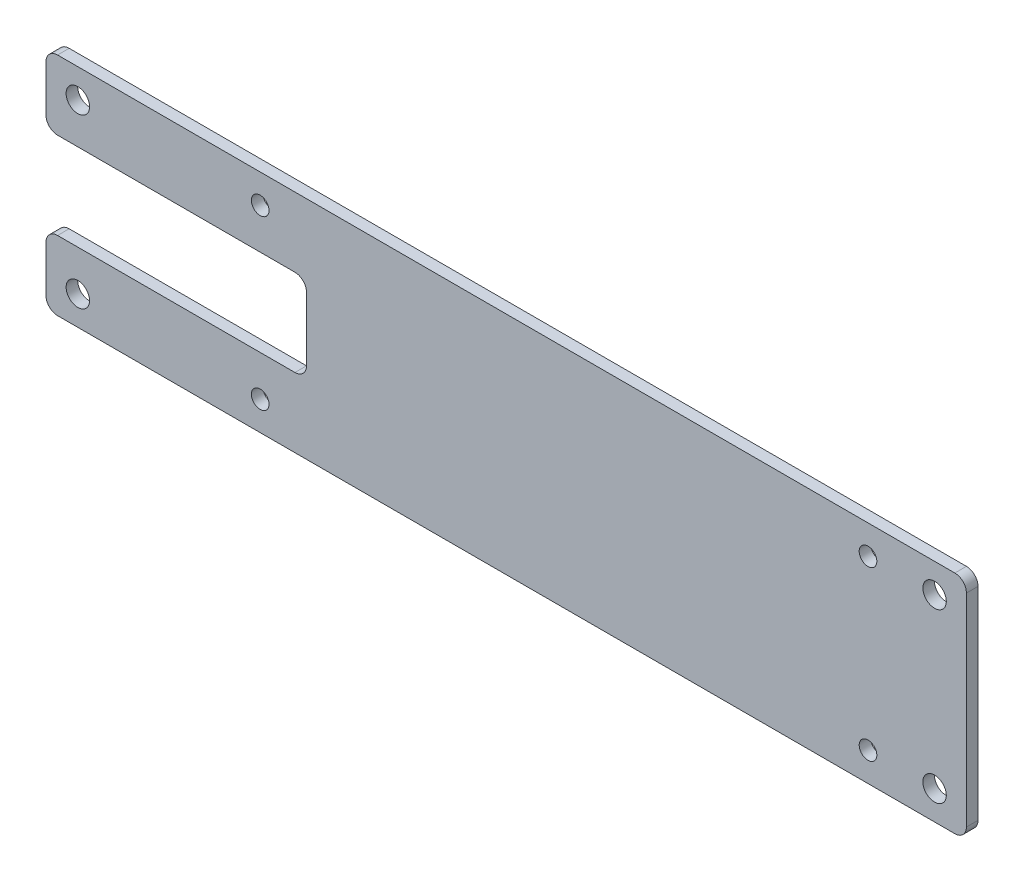
ISO-10303-21;
HEADER;
FILE_DESCRIPTION(('STEP AP214'),'2;1');
FILE_NAME('part.step','',(''),(''),'','','');
FILE_SCHEMA(('AUTOMOTIVE_DESIGN { 1 0 10303 214 1 1 1 1 }'));
ENDSEC;
DATA;
#1=APPLICATION_CONTEXT('core data for automotive mechanical design processes');
#2=APPLICATION_PROTOCOL_DEFINITION('international standard','automotive_design',2000,#1);
#3=PRODUCT_CONTEXT('',#1,'mechanical');
#4=PRODUCT('Part','Part','',(#3));
#5=PRODUCT_RELATED_PRODUCT_CATEGORY('part','',(#4));
#6=PRODUCT_DEFINITION_FORMATION('','',#4);
#7=PRODUCT_DEFINITION_CONTEXT('part definition',#1,'design');
#8=PRODUCT_DEFINITION('design','',#6,#7);
#9=PRODUCT_DEFINITION_SHAPE('','',#8);
#10=(LENGTH_UNIT() NAMED_UNIT(*) SI_UNIT(.MILLI.,.METRE.));
#11=(NAMED_UNIT(*) PLANE_ANGLE_UNIT() SI_UNIT($,.RADIAN.));
#12=(NAMED_UNIT(*) SI_UNIT($,.STERADIAN.) SOLID_ANGLE_UNIT());
#13=UNCERTAINTY_MEASURE_WITH_UNIT(LENGTH_MEASURE(1.E-05),#10,'distance_accuracy_value','');
#14=(GEOMETRIC_REPRESENTATION_CONTEXT(3) GLOBAL_UNCERTAINTY_ASSIGNED_CONTEXT((#13)) GLOBAL_UNIT_ASSIGNED_CONTEXT((#10,
#11,#12)) REPRESENTATION_CONTEXT('',''));
#15=CARTESIAN_POINT('',(0.,0.,0.));
#16=DIRECTION('',(0.,0.,1.));
#17=DIRECTION('',(1.,0.,0.));
#18=AXIS2_PLACEMENT_3D('',#15,#16,#17);
#19=CARTESIAN_POINT('',(-89.5,0.,2.));
#20=DIRECTION('',(-1.,0.,0.));
#21=DIRECTION('',(0.,0.,1.));
#22=AXIS2_PLACEMENT_3D('',#19,#20,#21);
#23=PLANE('',#22);
#24=DIRECTION('',(0.,1.,0.));
#25=VECTOR('',#24,1.);
#26=CARTESIAN_POINT('',(-89.5,0.,2.));
#27=LINE('',#26,#25);
#28=CARTESIAN_POINT('',(-89.5,-17.5,2.));
#29=VERTEX_POINT('',#28);
#30=CARTESIAN_POINT('',(-89.5,-9.5,2.));
#31=VERTEX_POINT('',#30);
#32=EDGE_CURVE('E305',#29,#31,#27,.T.);
#33=ORIENTED_EDGE('',*,*,#32,.T.);
#34=DIRECTION('',(0.,0.,1.));
#35=VECTOR('',#34,1.);
#36=CARTESIAN_POINT('',(-89.5,-9.5,2.));
#37=LINE('',#36,#35);
#38=CARTESIAN_POINT('',(-89.5,-9.5,0.));
#39=VERTEX_POINT('',#38);
#40=EDGE_CURVE('E219',#31,#39,#37,.F.);
#41=ORIENTED_EDGE('',*,*,#40,.T.);
#42=DIRECTION('',(0.,1.,0.));
#43=VECTOR('',#42,1.);
#44=CARTESIAN_POINT('',(-89.5,0.,0.));
#45=LINE('',#44,#43);
#46=CARTESIAN_POINT('',(-89.5,-17.5,0.));
#47=VERTEX_POINT('',#46);
#48=EDGE_CURVE('E268',#47,#39,#45,.T.);
#49=ORIENTED_EDGE('',*,*,#48,.F.);
#50=DIRECTION('',(0.,0.,-1.));
#51=VECTOR('',#50,1.);
#52=CARTESIAN_POINT('',(-89.5,-17.5,2.));
#53=LINE('',#52,#51);
#54=EDGE_CURVE('E221',#47,#29,#53,.F.);
#55=ORIENTED_EDGE('',*,*,#54,.T.);
#56=EDGE_LOOP('',(#33,#41,#49,#55));
#57=FACE_BOUND('',#56,.T.);
#58=ADVANCED_FACE('F38',(#57),#23,.T.);
#59=CARTESIAN_POINT('',(0.,0.,2.));
#60=DIRECTION('',(0.,0.,1.));
#61=DIRECTION('',(1.,0.,0.));
#62=AXIS2_PLACEMENT_3D('',#59,#60,#61);
#63=PLANE('',#62);
#64=CARTESIAN_POINT('',(-84.,-14.5,2.));
#65=DIRECTION('',(0.,0.,1.));
#66=DIRECTION('',(1.,0.,0.));
#67=AXIS2_PLACEMENT_3D('',#64,#65,#66);
#68=CIRCLE('',#67,2.02499999999999);
#69=CARTESIAN_POINT('',(-81.975,-14.5,2.));
#70=VERTEX_POINT('',#69);
#71=EDGE_CURVE('E244',#70,#70,#68,.T.);
#72=ORIENTED_EDGE('',*,*,#71,.F.);
#73=EDGE_LOOP('',(#72));
#74=FACE_BOUND('',#73,.T.);
#75=CARTESIAN_POINT('',(-84.,14.5,2.));
#76=DIRECTION('',(0.,0.,1.));
#77=DIRECTION('',(1.,0.,0.));
#78=AXIS2_PLACEMENT_3D('',#75,#76,#77);
#79=CIRCLE('',#78,2.025);
#80=CARTESIAN_POINT('',(-81.975,14.5,2.));
#81=VERTEX_POINT('',#80);
#82=EDGE_CURVE('E309',#81,#81,#79,.T.);
#83=ORIENTED_EDGE('',*,*,#82,.F.);
#84=EDGE_LOOP('',(#83));
#85=FACE_BOUND('',#84,.T.);
#86=CARTESIAN_POINT('',(52.5,14.5,2.));
#87=DIRECTION('',(0.,0.,1.));
#88=DIRECTION('',(1.,0.,0.));
#89=AXIS2_PLACEMENT_3D('',#86,#87,#88);
#90=CIRCLE('',#89,1.525);
#91=CARTESIAN_POINT('',(54.025,14.5,2.));
#92=VERTEX_POINT('',#91);
#93=EDGE_CURVE('E293',#92,#92,#90,.T.);
#94=ORIENTED_EDGE('',*,*,#93,.F.);
#95=EDGE_LOOP('',(#94));
#96=FACE_BOUND('',#95,.T.);
#97=CARTESIAN_POINT('',(52.5,-14.5,2.));
#98=DIRECTION('',(0.,0.,1.));
#99=DIRECTION('',(1.,0.,0.));
#100=AXIS2_PLACEMENT_3D('',#97,#98,#99);
#101=CIRCLE('',#100,1.525);
#102=CARTESIAN_POINT('',(54.025,-14.5,2.));
#103=VERTEX_POINT('',#102);
#104=EDGE_CURVE('E290',#103,#103,#101,.T.);
#105=ORIENTED_EDGE('',*,*,#104,.F.);
#106=EDGE_LOOP('',(#105));
#107=FACE_BOUND('',#106,.T.);
#108=CARTESIAN_POINT('',(-52.5,-14.5,2.));
#109=DIRECTION('',(0.,0.,1.));
#110=DIRECTION('',(1.,0.,0.));
#111=AXIS2_PLACEMENT_3D('',#108,#109,#110);
#112=CIRCLE('',#111,1.525);
#113=CARTESIAN_POINT('',(-50.975,-14.5,2.));
#114=VERTEX_POINT('',#113);
#115=EDGE_CURVE('E287',#114,#114,#112,.T.);
#116=ORIENTED_EDGE('',*,*,#115,.F.);
#117=EDGE_LOOP('',(#116));
#118=FACE_BOUND('',#117,.T.);
#119=CARTESIAN_POINT('',(-52.5,14.5,2.));
#120=DIRECTION('',(0.,0.,1.));
#121=DIRECTION('',(1.,0.,0.));
#122=AXIS2_PLACEMENT_3D('',#119,#120,#121);
#123=CIRCLE('',#122,1.525);
#124=CARTESIAN_POINT('',(-50.975,14.5,2.));
#125=VERTEX_POINT('',#124);
#126=EDGE_CURVE('E284',#125,#125,#123,.T.);
#127=ORIENTED_EDGE('',*,*,#126,.F.);
#128=EDGE_LOOP('',(#127));
#129=FACE_BOUND('',#128,.T.);
#130=CARTESIAN_POINT('',(64.,-14.5,2.));
#131=DIRECTION('',(0.,0.,1.));
#132=DIRECTION('',(1.,0.,0.));
#133=AXIS2_PLACEMENT_3D('',#130,#131,#132);
#134=CIRCLE('',#133,2.02499999999999);
#135=CARTESIAN_POINT('',(66.025,-14.5,2.));
#136=VERTEX_POINT('',#135);
#137=EDGE_CURVE('E281',#136,#136,#134,.T.);
#138=ORIENTED_EDGE('',*,*,#137,.F.);
#139=EDGE_LOOP('',(#138));
#140=FACE_BOUND('',#139,.T.);
#141=CARTESIAN_POINT('',(64.,14.5,2.));
#142=DIRECTION('',(0.,0.,1.));
#143=DIRECTION('',(1.,0.,0.));
#144=AXIS2_PLACEMENT_3D('',#141,#142,#143);
#145=CIRCLE('',#144,2.025);
#146=CARTESIAN_POINT('',(66.025,14.5,2.));
#147=VERTEX_POINT('',#146);
#148=EDGE_CURVE('E240',#147,#147,#145,.T.);
#149=ORIENTED_EDGE('',*,*,#148,.F.);
#150=EDGE_LOOP('',(#149));
#151=FACE_BOUND('',#150,.T.);
#152=DIRECTION('',(-1.,0.,0.));
#153=VECTOR('',#152,1.);
#154=CARTESIAN_POINT('',(0.,-7.49999999999999,2.));
#155=LINE('',#154,#153);
#156=CARTESIAN_POINT('',(-46.5,-7.5,2.));
#157=VERTEX_POINT('',#156);
#158=CARTESIAN_POINT('',(-87.5,-7.5,2.));
#159=VERTEX_POINT('',#158);
#160=EDGE_CURVE('E160',#157,#159,#155,.T.);
#161=ORIENTED_EDGE('',*,*,#160,.T.);
#162=CARTESIAN_POINT('',(-87.5,-9.5,2.));
#163=DIRECTION('',(0.,0.,1.));
#164=DIRECTION('',(1.,0.,0.));
#165=AXIS2_PLACEMENT_3D('',#162,#163,#164);
#166=CIRCLE('',#165,2.);
#167=EDGE_CURVE('E223',#159,#31,#166,.T.);
#168=ORIENTED_EDGE('',*,*,#167,.T.);
#169=ORIENTED_EDGE('',*,*,#32,.F.);
#170=CARTESIAN_POINT('',(-87.5,-17.5,2.));
#171=DIRECTION('',(0.,0.,1.));
#172=DIRECTION('',(1.,0.,0.));
#173=AXIS2_PLACEMENT_3D('',#170,#171,#172);
#174=CIRCLE('',#173,2.);
#175=CARTESIAN_POINT('',(-87.5,-19.5,2.));
#176=VERTEX_POINT('',#175);
#177=EDGE_CURVE('E225',#29,#176,#174,.T.);
#178=ORIENTED_EDGE('',*,*,#177,.T.);
#179=DIRECTION('',(-1.,0.,0.));
#180=VECTOR('',#179,1.);
#181=CARTESIAN_POINT('',(0.,-19.5,2.));
#182=LINE('',#181,#180);
#183=CARTESIAN_POINT('',(67.5,-19.5,2.));
#184=VERTEX_POINT('',#183);
#185=EDGE_CURVE('E302',#184,#176,#182,.T.);
#186=ORIENTED_EDGE('',*,*,#185,.F.);
#187=CARTESIAN_POINT('',(67.5,-17.5,2.));
#188=DIRECTION('',(0.,0.,1.));
#189=DIRECTION('',(1.,0.,0.));
#190=AXIS2_PLACEMENT_3D('',#187,#188,#189);
#191=CIRCLE('',#190,2.);
#192=CARTESIAN_POINT('',(69.5,-17.5,2.));
#193=VERTEX_POINT('',#192);
#194=EDGE_CURVE('E227',#184,#193,#191,.T.);
#195=ORIENTED_EDGE('',*,*,#194,.T.);
#196=DIRECTION('',(0.,1.,0.));
#197=VECTOR('',#196,1.);
#198=CARTESIAN_POINT('',(69.5,0.,2.));
#199=LINE('',#198,#197);
#200=CARTESIAN_POINT('',(69.5,17.5,2.));
#201=VERTEX_POINT('',#200);
#202=EDGE_CURVE('E299',#193,#201,#199,.T.);
#203=ORIENTED_EDGE('',*,*,#202,.T.);
#204=CARTESIAN_POINT('',(67.5,17.5,2.));
#205=DIRECTION('',(0.,0.,1.));
#206=DIRECTION('',(1.,0.,0.));
#207=AXIS2_PLACEMENT_3D('',#204,#205,#206);
#208=CIRCLE('',#207,2.);
#209=CARTESIAN_POINT('',(67.5,19.5,2.));
#210=VERTEX_POINT('',#209);
#211=EDGE_CURVE('E229',#201,#210,#208,.T.);
#212=ORIENTED_EDGE('',*,*,#211,.T.);
#213=DIRECTION('',(-1.,0.,0.));
#214=VECTOR('',#213,1.);
#215=CARTESIAN_POINT('',(0.,19.5,2.));
#216=LINE('',#215,#214);
#217=CARTESIAN_POINT('',(-87.5,19.5,2.));
#218=VERTEX_POINT('',#217);
#219=EDGE_CURVE('E296',#210,#218,#216,.T.);
#220=ORIENTED_EDGE('',*,*,#219,.T.);
#221=CARTESIAN_POINT('',(-87.5,17.5,2.));
#222=DIRECTION('',(0.,0.,1.));
#223=DIRECTION('',(1.,0.,0.));
#224=AXIS2_PLACEMENT_3D('',#221,#222,#223);
#225=CIRCLE('',#224,2.);
#226=CARTESIAN_POINT('',(-89.5,17.5,2.));
#227=VERTEX_POINT('',#226);
#228=EDGE_CURVE('E231',#218,#227,#225,.T.);
#229=ORIENTED_EDGE('',*,*,#228,.T.);
#230=CARTESIAN_POINT('',(-89.5,9.5,2.));
#231=VERTEX_POINT('',#230);
#232=EDGE_CURVE('E306',#231,#227,#27,.T.);
#233=ORIENTED_EDGE('',*,*,#232,.F.);
#234=CARTESIAN_POINT('',(-87.5,9.5,2.));
#235=DIRECTION('',(0.,0.,1.));
#236=DIRECTION('',(1.,0.,0.));
#237=AXIS2_PLACEMENT_3D('',#234,#235,#236);
#238=CIRCLE('',#237,2.);
#239=CARTESIAN_POINT('',(-87.5,7.5,2.));
#240=VERTEX_POINT('',#239);
#241=EDGE_CURVE('E233',#231,#240,#238,.T.);
#242=ORIENTED_EDGE('',*,*,#241,.T.);
#243=DIRECTION('',(-1.,0.,0.));
#244=VECTOR('',#243,1.);
#245=CARTESIAN_POINT('',(0.,7.50000000000001,2.));
#246=LINE('',#245,#244);
#247=CARTESIAN_POINT('',(-46.5,7.5,2.));
#248=VERTEX_POINT('',#247);
#249=EDGE_CURVE('E278',#248,#240,#246,.T.);
#250=ORIENTED_EDGE('',*,*,#249,.F.);
#251=CARTESIAN_POINT('',(-46.5,5.5,2.));
#252=DIRECTION('',(0.,0.,1.));
#253=DIRECTION('',(1.,0.,0.));
#254=AXIS2_PLACEMENT_3D('',#251,#252,#253);
#255=CIRCLE('',#254,2.);
#256=CARTESIAN_POINT('',(-44.5,5.5,2.));
#257=VERTEX_POINT('',#256);
#258=EDGE_CURVE('E46',#248,#257,#255,.F.);
#259=ORIENTED_EDGE('',*,*,#258,.T.);
#260=DIRECTION('',(0.,1.,0.));
#261=VECTOR('',#260,1.);
#262=CARTESIAN_POINT('',(-44.5,0.,2.));
#263=LINE('',#262,#261);
#264=CARTESIAN_POINT('',(-44.5,-5.5,2.));
#265=VERTEX_POINT('',#264);
#266=EDGE_CURVE('E316',#265,#257,#263,.T.);
#267=ORIENTED_EDGE('',*,*,#266,.F.);
#268=CARTESIAN_POINT('',(-46.5,-5.5,2.));
#269=DIRECTION('',(0.,0.,1.));
#270=DIRECTION('',(1.,0.,0.));
#271=AXIS2_PLACEMENT_3D('',#268,#269,#270);
#272=CIRCLE('',#271,2.);
#273=EDGE_CURVE('E178',#265,#157,#272,.F.);
#274=ORIENTED_EDGE('',*,*,#273,.T.);
#275=EDGE_LOOP('',(#161,#168,#169,#178,#186,#195,#203,#212,#220,#229,#233,#242,#250,#259,#267,#274));
#276=FACE_BOUND('',#275,.T.);
#277=ADVANCED_FACE('F320',(#74,#85,#96,#107,#118,#129,#140,#151,#276),#63,.T.);
#278=CARTESIAN_POINT('',(0.,0.,0.));
#279=DIRECTION('',(0.,0.,1.));
#280=DIRECTION('',(1.,0.,0.));
#281=AXIS2_PLACEMENT_3D('',#278,#279,#280);
#282=PLANE('',#281);
#283=CARTESIAN_POINT('',(64.,14.5,0.));
#284=DIRECTION('',(0.,0.,1.));
#285=DIRECTION('',(1.,0.,0.));
#286=AXIS2_PLACEMENT_3D('',#283,#284,#285);
#287=CIRCLE('',#286,2.025);
#288=CARTESIAN_POINT('',(66.025,14.5,0.));
#289=VERTEX_POINT('',#288);
#290=EDGE_CURVE('E241',#289,#289,#287,.T.);
#291=ORIENTED_EDGE('',*,*,#290,.T.);
#292=EDGE_LOOP('',(#291));
#293=FACE_BOUND('',#292,.T.);
#294=CARTESIAN_POINT('',(64.,-14.5,0.));
#295=DIRECTION('',(0.,0.,1.));
#296=DIRECTION('',(1.,0.,0.));
#297=AXIS2_PLACEMENT_3D('',#294,#295,#296);
#298=CIRCLE('',#297,2.02499999999999);
#299=CARTESIAN_POINT('',(66.025,-14.5,0.));
#300=VERTEX_POINT('',#299);
#301=EDGE_CURVE('E245',#300,#300,#298,.T.);
#302=ORIENTED_EDGE('',*,*,#301,.T.);
#303=EDGE_LOOP('',(#302));
#304=FACE_BOUND('',#303,.T.);
#305=CARTESIAN_POINT('',(-52.5,14.5,0.));
#306=DIRECTION('',(0.,0.,1.));
#307=DIRECTION('',(1.,0.,0.));
#308=AXIS2_PLACEMENT_3D('',#305,#306,#307);
#309=CIRCLE('',#308,1.525);
#310=CARTESIAN_POINT('',(-50.975,14.5,0.));
#311=VERTEX_POINT('',#310);
#312=EDGE_CURVE('E248',#311,#311,#309,.T.);
#313=ORIENTED_EDGE('',*,*,#312,.T.);
#314=EDGE_LOOP('',(#313));
#315=FACE_BOUND('',#314,.T.);
#316=CARTESIAN_POINT('',(-52.5,-14.5,0.));
#317=DIRECTION('',(0.,0.,1.));
#318=DIRECTION('',(1.,0.,0.));
#319=AXIS2_PLACEMENT_3D('',#316,#317,#318);
#320=CIRCLE('',#319,1.525);
#321=CARTESIAN_POINT('',(-50.975,-14.5,0.));
#322=VERTEX_POINT('',#321);
#323=EDGE_CURVE('E251',#322,#322,#320,.T.);
#324=ORIENTED_EDGE('',*,*,#323,.T.);
#325=EDGE_LOOP('',(#324));
#326=FACE_BOUND('',#325,.T.);
#327=CARTESIAN_POINT('',(52.5,-14.5,0.));
#328=DIRECTION('',(0.,0.,1.));
#329=DIRECTION('',(1.,0.,0.));
#330=AXIS2_PLACEMENT_3D('',#327,#328,#329);
#331=CIRCLE('',#330,1.525);
#332=CARTESIAN_POINT('',(54.025,-14.5,0.));
#333=VERTEX_POINT('',#332);
#334=EDGE_CURVE('E254',#333,#333,#331,.T.);
#335=ORIENTED_EDGE('',*,*,#334,.T.);
#336=EDGE_LOOP('',(#335));
#337=FACE_BOUND('',#336,.T.);
#338=CARTESIAN_POINT('',(52.5,14.5,0.));
#339=DIRECTION('',(0.,0.,1.));
#340=DIRECTION('',(1.,0.,0.));
#341=AXIS2_PLACEMENT_3D('',#338,#339,#340);
#342=CIRCLE('',#341,1.525);
#343=CARTESIAN_POINT('',(54.025,14.5,0.));
#344=VERTEX_POINT('',#343);
#345=EDGE_CURVE('E257',#344,#344,#342,.T.);
#346=ORIENTED_EDGE('',*,*,#345,.T.);
#347=EDGE_LOOP('',(#346));
#348=FACE_BOUND('',#347,.T.);
#349=CARTESIAN_POINT('',(-84.,14.5,0.));
#350=DIRECTION('',(0.,0.,1.));
#351=DIRECTION('',(1.,0.,0.));
#352=AXIS2_PLACEMENT_3D('',#349,#350,#351);
#353=CIRCLE('',#352,2.025);
#354=CARTESIAN_POINT('',(-81.975,14.5,0.));
#355=VERTEX_POINT('',#354);
#356=EDGE_CURVE('E272',#355,#355,#353,.T.);
#357=ORIENTED_EDGE('',*,*,#356,.T.);
#358=EDGE_LOOP('',(#357));
#359=FACE_BOUND('',#358,.T.);
#360=CARTESIAN_POINT('',(-84.,-14.5,0.));
#361=DIRECTION('',(0.,0.,1.));
#362=DIRECTION('',(1.,0.,0.));
#363=AXIS2_PLACEMENT_3D('',#360,#361,#362);
#364=CIRCLE('',#363,2.02499999999999);
#365=CARTESIAN_POINT('',(-81.975,-14.5,0.));
#366=VERTEX_POINT('',#365);
#367=EDGE_CURVE('E275',#366,#366,#364,.T.);
#368=ORIENTED_EDGE('',*,*,#367,.T.);
#369=EDGE_LOOP('',(#368));
#370=FACE_BOUND('',#369,.T.);
#371=ORIENTED_EDGE('',*,*,#48,.T.);
#372=CARTESIAN_POINT('',(-87.5,-9.5,0.));
#373=DIRECTION('',(0.,0.,1.));
#374=DIRECTION('',(1.,0.,0.));
#375=AXIS2_PLACEMENT_3D('',#372,#373,#374);
#376=CIRCLE('',#375,2.);
#377=CARTESIAN_POINT('',(-87.5,-7.5,0.));
#378=VERTEX_POINT('',#377);
#379=EDGE_CURVE('E171',#39,#378,#376,.F.);
#380=ORIENTED_EDGE('',*,*,#379,.T.);
#381=DIRECTION('',(-1.,0.,0.));
#382=VECTOR('',#381,1.);
#383=CARTESIAN_POINT('',(0.,-7.49999999999999,0.));
#384=LINE('',#383,#382);
#385=CARTESIAN_POINT('',(-46.5,-7.5,0.));
#386=VERTEX_POINT('',#385);
#387=EDGE_CURVE('E157',#386,#378,#384,.T.);
#388=ORIENTED_EDGE('',*,*,#387,.F.);
#389=CARTESIAN_POINT('',(-46.5,-5.5,0.));
#390=DIRECTION('',(0.,0.,1.));
#391=DIRECTION('',(1.,0.,0.));
#392=AXIS2_PLACEMENT_3D('',#389,#390,#391);
#393=CIRCLE('',#392,2.);
#394=CARTESIAN_POINT('',(-44.5,-5.5,0.));
#395=VERTEX_POINT('',#394);
#396=EDGE_CURVE('E168',#386,#395,#393,.T.);
#397=ORIENTED_EDGE('',*,*,#396,.T.);
#398=DIRECTION('',(0.,1.,0.));
#399=VECTOR('',#398,1.);
#400=CARTESIAN_POINT('',(-44.5,0.,0.));
#401=LINE('',#400,#399);
#402=CARTESIAN_POINT('',(-44.5,5.5,0.));
#403=VERTEX_POINT('',#402);
#404=EDGE_CURVE('E238',#395,#403,#401,.T.);
#405=ORIENTED_EDGE('',*,*,#404,.T.);
#406=CARTESIAN_POINT('',(-46.5,5.5,0.));
#407=DIRECTION('',(0.,0.,1.));
#408=DIRECTION('',(1.,0.,0.));
#409=AXIS2_PLACEMENT_3D('',#406,#407,#408);
#410=CIRCLE('',#409,2.);
#411=CARTESIAN_POINT('',(-46.5,7.5,0.));
#412=VERTEX_POINT('',#411);
#413=EDGE_CURVE('E11',#403,#412,#410,.T.);
#414=ORIENTED_EDGE('',*,*,#413,.T.);
#415=DIRECTION('',(-1.,0.,0.));
#416=VECTOR('',#415,1.);
#417=CARTESIAN_POINT('',(0.,7.50000000000001,0.));
#418=LINE('',#417,#416);
#419=CARTESIAN_POINT('',(-87.5,7.5,0.));
#420=VERTEX_POINT('',#419);
#421=EDGE_CURVE('E172',#412,#420,#418,.T.);
#422=ORIENTED_EDGE('',*,*,#421,.T.);
#423=CARTESIAN_POINT('',(-87.5,9.5,0.));
#424=DIRECTION('',(0.,0.,1.));
#425=DIRECTION('',(1.,0.,0.));
#426=AXIS2_PLACEMENT_3D('',#423,#424,#425);
#427=CIRCLE('',#426,2.);
#428=CARTESIAN_POINT('',(-89.5,9.5,0.));
#429=VERTEX_POINT('',#428);
#430=EDGE_CURVE('E217',#420,#429,#427,.F.);
#431=ORIENTED_EDGE('',*,*,#430,.T.);
#432=CARTESIAN_POINT('',(-89.5,17.5,0.));
#433=VERTEX_POINT('',#432);
#434=EDGE_CURVE('E269',#429,#433,#45,.T.);
#435=ORIENTED_EDGE('',*,*,#434,.T.);
#436=CARTESIAN_POINT('',(-87.5,17.5,0.));
#437=DIRECTION('',(0.,0.,1.));
#438=DIRECTION('',(1.,0.,0.));
#439=AXIS2_PLACEMENT_3D('',#436,#437,#438);
#440=CIRCLE('',#439,2.);
#441=CARTESIAN_POINT('',(-87.5,19.5,0.));
#442=VERTEX_POINT('',#441);
#443=EDGE_CURVE('E215',#433,#442,#440,.F.);
#444=ORIENTED_EDGE('',*,*,#443,.T.);
#445=DIRECTION('',(-1.,0.,0.));
#446=VECTOR('',#445,1.);
#447=CARTESIAN_POINT('',(0.,19.5,0.));
#448=LINE('',#447,#446);
#449=CARTESIAN_POINT('',(67.5,19.5,0.));
#450=VERTEX_POINT('',#449);
#451=EDGE_CURVE('E260',#450,#442,#448,.T.);
#452=ORIENTED_EDGE('',*,*,#451,.F.);
#453=CARTESIAN_POINT('',(67.5,17.5,0.));
#454=DIRECTION('',(0.,0.,1.));
#455=DIRECTION('',(1.,0.,0.));
#456=AXIS2_PLACEMENT_3D('',#453,#454,#455);
#457=CIRCLE('',#456,2.);
#458=CARTESIAN_POINT('',(69.5,17.5,0.));
#459=VERTEX_POINT('',#458);
#460=EDGE_CURVE('E213',#450,#459,#457,.F.);
#461=ORIENTED_EDGE('',*,*,#460,.T.);
#462=DIRECTION('',(0.,1.,0.));
#463=VECTOR('',#462,1.);
#464=CARTESIAN_POINT('',(69.5,0.,0.));
#465=LINE('',#464,#463);
#466=CARTESIAN_POINT('',(69.5,-17.5,0.));
#467=VERTEX_POINT('',#466);
#468=EDGE_CURVE('E263',#467,#459,#465,.T.);
#469=ORIENTED_EDGE('',*,*,#468,.F.);
#470=CARTESIAN_POINT('',(67.5,-17.5,0.));
#471=DIRECTION('',(0.,0.,1.));
#472=DIRECTION('',(1.,0.,0.));
#473=AXIS2_PLACEMENT_3D('',#470,#471,#472);
#474=CIRCLE('',#473,2.);
#475=CARTESIAN_POINT('',(67.5,-19.5,0.));
#476=VERTEX_POINT('',#475);
#477=EDGE_CURVE('E61',#467,#476,#474,.F.);
#478=ORIENTED_EDGE('',*,*,#477,.T.);
#479=DIRECTION('',(-1.,0.,0.));
#480=VECTOR('',#479,1.);
#481=CARTESIAN_POINT('',(0.,-19.5,0.));
#482=LINE('',#481,#480);
#483=CARTESIAN_POINT('',(-87.5,-19.5,0.));
#484=VERTEX_POINT('',#483);
#485=EDGE_CURVE('E266',#476,#484,#482,.T.);
#486=ORIENTED_EDGE('',*,*,#485,.T.);
#487=CARTESIAN_POINT('',(-87.5,-17.5,0.));
#488=DIRECTION('',(0.,0.,1.));
#489=DIRECTION('',(1.,0.,0.));
#490=AXIS2_PLACEMENT_3D('',#487,#488,#489);
#491=CIRCLE('',#490,2.);
#492=EDGE_CURVE('E53',#484,#47,#491,.F.);
#493=ORIENTED_EDGE('',*,*,#492,.T.);
#494=EDGE_LOOP('',(#371,#380,#388,#397,#405,#414,#422,#431,#435,#444,#452,#461,#469,#478,#486,#493));
#495=FACE_BOUND('',#494,.T.);
#496=ADVANCED_FACE('F166',(#293,#304,#315,#326,#337,#348,#359,#370,#495),#282,.F.);
#497=ORIENTED_EDGE('',*,*,#232,.T.);
#498=DIRECTION('',(0.,0.,-1.));
#499=VECTOR('',#498,1.);
#500=CARTESIAN_POINT('',(-89.5,17.5,0.));
#501=LINE('',#500,#499);
#502=EDGE_CURVE('E190',#227,#433,#501,.T.);
#503=ORIENTED_EDGE('',*,*,#502,.T.);
#504=ORIENTED_EDGE('',*,*,#434,.F.);
#505=DIRECTION('',(0.,0.,1.));
#506=VECTOR('',#505,1.);
#507=CARTESIAN_POINT('',(-89.5,9.5,2.));
#508=LINE('',#507,#506);
#509=EDGE_CURVE('E193',#429,#231,#508,.T.);
#510=ORIENTED_EDGE('',*,*,#509,.T.);
#511=EDGE_LOOP('',(#497,#503,#504,#510));
#512=FACE_BOUND('',#511,.T.);
#513=ADVANCED_FACE('F342',(#512),#23,.T.);
#514=CARTESIAN_POINT('',(0.,-19.5,2.));
#515=DIRECTION('',(0.,-1.,0.));
#516=DIRECTION('',(0.,0.,-1.));
#517=AXIS2_PLACEMENT_3D('',#514,#515,#516);
#518=PLANE('',#517);
#519=ORIENTED_EDGE('',*,*,#185,.T.);
#520=DIRECTION('',(0.,0.,-1.));
#521=VECTOR('',#520,1.);
#522=CARTESIAN_POINT('',(-87.5,-19.5,2.));
#523=LINE('',#522,#521);
#524=EDGE_CURVE('E206',#176,#484,#523,.T.);
#525=ORIENTED_EDGE('',*,*,#524,.T.);
#526=ORIENTED_EDGE('',*,*,#485,.F.);
#527=DIRECTION('',(0.,0.,-1.));
#528=VECTOR('',#527,1.);
#529=CARTESIAN_POINT('',(67.5,-19.5,2.));
#530=LINE('',#529,#528);
#531=EDGE_CURVE('E208',#476,#184,#530,.F.);
#532=ORIENTED_EDGE('',*,*,#531,.T.);
#533=EDGE_LOOP('',(#519,#525,#526,#532));
#534=FACE_BOUND('',#533,.T.);
#535=ADVANCED_FACE('F367',(#534),#518,.T.);
#536=CARTESIAN_POINT('',(69.5,0.,2.));
#537=DIRECTION('',(-1.,0.,0.));
#538=DIRECTION('',(0.,0.,1.));
#539=AXIS2_PLACEMENT_3D('',#536,#537,#538);
#540=PLANE('',#539);
#541=ORIENTED_EDGE('',*,*,#202,.F.);
#542=DIRECTION('',(0.,0.,-1.));
#543=VECTOR('',#542,1.);
#544=CARTESIAN_POINT('',(69.5,-17.5,0.));
#545=LINE('',#544,#543);
#546=EDGE_CURVE('E201',#193,#467,#545,.T.);
#547=ORIENTED_EDGE('',*,*,#546,.T.);
#548=ORIENTED_EDGE('',*,*,#468,.T.);
#549=DIRECTION('',(0.,0.,-1.));
#550=VECTOR('',#549,1.);
#551=CARTESIAN_POINT('',(69.5,17.5,2.));
#552=LINE('',#551,#550);
#553=EDGE_CURVE('E204',#459,#201,#552,.F.);
#554=ORIENTED_EDGE('',*,*,#553,.T.);
#555=EDGE_LOOP('',(#541,#547,#548,#554));
#556=FACE_BOUND('',#555,.T.);
#557=ADVANCED_FACE('F359',(#556),#540,.F.);
#558=CARTESIAN_POINT('',(64.,-14.5,2.));
#559=DIRECTION('',(0.,0.,-1.));
#560=DIRECTION('',(-1.,0.,0.));
#561=AXIS2_PLACEMENT_3D('',#558,#559,#560);
#562=CYLINDRICAL_SURFACE('',#561,2.02499999999999);
#563=ORIENTED_EDGE('',*,*,#137,.T.);
#564=EDGE_LOOP('',(#563));
#565=FACE_BOUND('',#564,.T.);
#566=ORIENTED_EDGE('',*,*,#301,.F.);
#567=EDGE_LOOP('',(#566));
#568=FACE_BOUND('',#567,.T.);
#569=ADVANCED_FACE('F410',(#565,#568),#562,.F.);
#570=CARTESIAN_POINT('',(-52.5,14.5,2.));
#571=DIRECTION('',(0.,0.,-1.));
#572=DIRECTION('',(-1.,0.,0.));
#573=AXIS2_PLACEMENT_3D('',#570,#571,#572);
#574=CYLINDRICAL_SURFACE('',#573,1.525);
#575=ORIENTED_EDGE('',*,*,#126,.T.);
#576=EDGE_LOOP('',(#575));
#577=FACE_BOUND('',#576,.T.);
#578=ORIENTED_EDGE('',*,*,#312,.F.);
#579=EDGE_LOOP('',(#578));
#580=FACE_BOUND('',#579,.T.);
#581=ADVANCED_FACE('F413',(#577,#580),#574,.F.);
#582=CARTESIAN_POINT('',(-52.5,-14.5,2.));
#583=DIRECTION('',(0.,0.,-1.));
#584=DIRECTION('',(-1.,0.,0.));
#585=AXIS2_PLACEMENT_3D('',#582,#583,#584);
#586=CYLINDRICAL_SURFACE('',#585,1.525);
#587=ORIENTED_EDGE('',*,*,#115,.T.);
#588=EDGE_LOOP('',(#587));
#589=FACE_BOUND('',#588,.T.);
#590=ORIENTED_EDGE('',*,*,#323,.F.);
#591=EDGE_LOOP('',(#590));
#592=FACE_BOUND('',#591,.T.);
#593=ADVANCED_FACE('F417',(#589,#592),#586,.F.);
#594=CARTESIAN_POINT('',(52.5,-14.5,2.));
#595=DIRECTION('',(0.,0.,-1.));
#596=DIRECTION('',(-1.,0.,0.));
#597=AXIS2_PLACEMENT_3D('',#594,#595,#596);
#598=CYLINDRICAL_SURFACE('',#597,1.525);
#599=ORIENTED_EDGE('',*,*,#104,.T.);
#600=EDGE_LOOP('',(#599));
#601=FACE_BOUND('',#600,.T.);
#602=ORIENTED_EDGE('',*,*,#334,.F.);
#603=EDGE_LOOP('',(#602));
#604=FACE_BOUND('',#603,.T.);
#605=ADVANCED_FACE('F421',(#601,#604),#598,.F.);
#606=CARTESIAN_POINT('',(52.5,14.5,2.));
#607=DIRECTION('',(0.,0.,-1.));
#608=DIRECTION('',(-1.,0.,0.));
#609=AXIS2_PLACEMENT_3D('',#606,#607,#608);
#610=CYLINDRICAL_SURFACE('',#609,1.525);
#611=ORIENTED_EDGE('',*,*,#93,.T.);
#612=EDGE_LOOP('',(#611));
#613=FACE_BOUND('',#612,.T.);
#614=ORIENTED_EDGE('',*,*,#345,.F.);
#615=EDGE_LOOP('',(#614));
#616=FACE_BOUND('',#615,.T.);
#617=ADVANCED_FACE('F425',(#613,#616),#610,.F.);
#618=CARTESIAN_POINT('',(0.,19.5,2.));
#619=DIRECTION('',(0.,-1.,0.));
#620=DIRECTION('',(1.,0.,0.));
#621=AXIS2_PLACEMENT_3D('',#618,#619,#620);
#622=PLANE('',#621);
#623=ORIENTED_EDGE('',*,*,#219,.F.);
#624=DIRECTION('',(0.,0.,-1.));
#625=VECTOR('',#624,1.);
#626=CARTESIAN_POINT('',(67.5,19.5,2.));
#627=LINE('',#626,#625);
#628=EDGE_CURVE('E196',#210,#450,#627,.T.);
#629=ORIENTED_EDGE('',*,*,#628,.T.);
#630=ORIENTED_EDGE('',*,*,#451,.T.);
#631=DIRECTION('',(0.,0.,-1.));
#632=VECTOR('',#631,1.);
#633=CARTESIAN_POINT('',(-87.5,19.5,2.));
#634=LINE('',#633,#632);
#635=EDGE_CURVE('E199',#442,#218,#634,.F.);
#636=ORIENTED_EDGE('',*,*,#635,.T.);
#637=EDGE_LOOP('',(#623,#629,#630,#636));
#638=FACE_BOUND('',#637,.T.);
#639=ADVANCED_FACE('F349',(#638),#622,.F.);
#640=CARTESIAN_POINT('',(-84.,14.5,2.));
#641=DIRECTION('',(0.,0.,-1.));
#642=DIRECTION('',(-1.,0.,0.));
#643=AXIS2_PLACEMENT_3D('',#640,#641,#642);
#644=CYLINDRICAL_SURFACE('',#643,2.025);
#645=ORIENTED_EDGE('',*,*,#82,.T.);
#646=EDGE_LOOP('',(#645));
#647=FACE_BOUND('',#646,.T.);
#648=ORIENTED_EDGE('',*,*,#356,.F.);
#649=EDGE_LOOP('',(#648));
#650=FACE_BOUND('',#649,.T.);
#651=ADVANCED_FACE('F432',(#647,#650),#644,.F.);
#652=CARTESIAN_POINT('',(-84.,-14.5,2.));
#653=DIRECTION('',(0.,0.,-1.));
#654=DIRECTION('',(-1.,0.,0.));
#655=AXIS2_PLACEMENT_3D('',#652,#653,#654);
#656=CYLINDRICAL_SURFACE('',#655,2.02499999999999);
#657=ORIENTED_EDGE('',*,*,#71,.T.);
#658=EDGE_LOOP('',(#657));
#659=FACE_BOUND('',#658,.T.);
#660=ORIENTED_EDGE('',*,*,#367,.F.);
#661=EDGE_LOOP('',(#660));
#662=FACE_BOUND('',#661,.T.);
#663=ADVANCED_FACE('F408',(#659,#662),#656,.F.);
#664=CARTESIAN_POINT('',(64.,14.5,2.));
#665=DIRECTION('',(0.,0.,-1.));
#666=DIRECTION('',(-1.,0.,0.));
#667=AXIS2_PLACEMENT_3D('',#664,#665,#666);
#668=CYLINDRICAL_SURFACE('',#667,2.025);
#669=ORIENTED_EDGE('',*,*,#148,.T.);
#670=EDGE_LOOP('',(#669));
#671=FACE_BOUND('',#670,.T.);
#672=ORIENTED_EDGE('',*,*,#290,.F.);
#673=EDGE_LOOP('',(#672));
#674=FACE_BOUND('',#673,.T.);
#675=ADVANCED_FACE('F405',(#671,#674),#668,.F.);
#676=CARTESIAN_POINT('',(0.,-7.49999999999999,-8.));
#677=DIRECTION('',(0.,1.,0.));
#678=DIRECTION('',(-1.,0.,0.));
#679=AXIS2_PLACEMENT_3D('',#676,#677,#678);
#680=PLANE('',#679);
#681=ORIENTED_EDGE('',*,*,#387,.T.);
#682=DIRECTION('',(0.,0.,1.));
#683=VECTOR('',#682,1.);
#684=CARTESIAN_POINT('',(-87.5,-7.5,-8.));
#685=LINE('',#684,#683);
#686=EDGE_CURVE('E163',#378,#159,#685,.T.);
#687=ORIENTED_EDGE('',*,*,#686,.T.);
#688=ORIENTED_EDGE('',*,*,#160,.F.);
#689=DIRECTION('',(0.,0.,1.));
#690=VECTOR('',#689,1.);
#691=CARTESIAN_POINT('',(-46.5,-7.5,-8.));
#692=LINE('',#691,#690);
#693=EDGE_CURVE('E153',#157,#386,#692,.F.);
#694=ORIENTED_EDGE('',*,*,#693,.T.);
#695=EDGE_LOOP('',(#681,#687,#688,#694));
#696=FACE_BOUND('',#695,.T.);
#697=ADVANCED_FACE('F155',(#696),#680,.T.);
#698=CARTESIAN_POINT('',(0.,7.50000000000001,-8.));
#699=DIRECTION('',(0.,1.,0.));
#700=DIRECTION('',(-1.,0.,0.));
#701=AXIS2_PLACEMENT_3D('',#698,#699,#700);
#702=PLANE('',#701);
#703=ORIENTED_EDGE('',*,*,#249,.T.);
#704=DIRECTION('',(0.,0.,1.));
#705=VECTOR('',#704,1.);
#706=CARTESIAN_POINT('',(-87.5,7.5,0.));
#707=LINE('',#706,#705);
#708=EDGE_CURVE('E185',#240,#420,#707,.F.);
#709=ORIENTED_EDGE('',*,*,#708,.T.);
#710=ORIENTED_EDGE('',*,*,#421,.F.);
#711=DIRECTION('',(0.,0.,1.));
#712=VECTOR('',#711,1.);
#713=CARTESIAN_POINT('',(-46.5,7.5,2.));
#714=LINE('',#713,#712);
#715=EDGE_CURVE('E187',#412,#248,#714,.T.);
#716=ORIENTED_EDGE('',*,*,#715,.T.);
#717=EDGE_LOOP('',(#703,#709,#710,#716));
#718=FACE_BOUND('',#717,.T.);
#719=ADVANCED_FACE('F333',(#718),#702,.F.);
#720=CARTESIAN_POINT('',(-44.5,0.,-8.));
#721=DIRECTION('',(1.,0.,0.));
#722=DIRECTION('',(0.,0.,-1.));
#723=AXIS2_PLACEMENT_3D('',#720,#721,#722);
#724=PLANE('',#723);
#725=ORIENTED_EDGE('',*,*,#404,.F.);
#726=DIRECTION('',(0.,0.,1.));
#727=VECTOR('',#726,1.);
#728=CARTESIAN_POINT('',(-44.5,-5.5,-8.));
#729=LINE('',#728,#727);
#730=EDGE_CURVE('E177',#395,#265,#729,.T.);
#731=ORIENTED_EDGE('',*,*,#730,.T.);
#732=ORIENTED_EDGE('',*,*,#266,.T.);
#733=DIRECTION('',(0.,0.,1.));
#734=VECTOR('',#733,1.);
#735=CARTESIAN_POINT('',(-44.5,5.5,0.));
#736=LINE('',#735,#734);
#737=EDGE_CURVE('E183',#257,#403,#736,.F.);
#738=ORIENTED_EDGE('',*,*,#737,.T.);
#739=EDGE_LOOP('',(#725,#731,#732,#738));
#740=FACE_BOUND('',#739,.T.);
#741=ADVANCED_FACE('F325',(#740),#724,.F.);
#742=CARTESIAN_POINT('',(-87.5,-9.5,-8.));
#743=DIRECTION('',(0.,0.,1.));
#744=DIRECTION('',(1.,0.,0.));
#745=AXIS2_PLACEMENT_3D('',#742,#743,#744);
#746=CYLINDRICAL_SURFACE('',#745,2.);
#747=ORIENTED_EDGE('',*,*,#379,.F.);
#748=ORIENTED_EDGE('',*,*,#40,.F.);
#749=ORIENTED_EDGE('',*,*,#167,.F.);
#750=ORIENTED_EDGE('',*,*,#686,.F.);
#751=EDGE_LOOP('',(#747,#748,#749,#750));
#752=FACE_BOUND('',#751,.T.);
#753=ADVANCED_FACE('F374',(#752),#746,.T.);
#754=CARTESIAN_POINT('',(-87.5,-17.5,2.));
#755=DIRECTION('',(0.,0.,-1.));
#756=DIRECTION('',(-1.,0.,0.));
#757=AXIS2_PLACEMENT_3D('',#754,#755,#756);
#758=CYLINDRICAL_SURFACE('',#757,2.);
#759=ORIENTED_EDGE('',*,*,#177,.F.);
#760=ORIENTED_EDGE('',*,*,#54,.F.);
#761=ORIENTED_EDGE('',*,*,#492,.F.);
#762=ORIENTED_EDGE('',*,*,#524,.F.);
#763=EDGE_LOOP('',(#759,#760,#761,#762));
#764=FACE_BOUND('',#763,.T.);
#765=ADVANCED_FACE('F369',(#764),#758,.T.);
#766=CARTESIAN_POINT('',(67.5,-17.5,2.));
#767=DIRECTION('',(0.,0.,1.));
#768=DIRECTION('',(1.,0.,0.));
#769=AXIS2_PLACEMENT_3D('',#766,#767,#768);
#770=CYLINDRICAL_SURFACE('',#769,2.);
#771=ORIENTED_EDGE('',*,*,#194,.F.);
#772=ORIENTED_EDGE('',*,*,#531,.F.);
#773=ORIENTED_EDGE('',*,*,#477,.F.);
#774=ORIENTED_EDGE('',*,*,#546,.F.);
#775=EDGE_LOOP('',(#771,#772,#773,#774));
#776=FACE_BOUND('',#775,.T.);
#777=ADVANCED_FACE('F363',(#776),#770,.T.);
#778=CARTESIAN_POINT('',(67.5,17.5,2.));
#779=DIRECTION('',(0.,0.,-1.));
#780=DIRECTION('',(-1.,0.,0.));
#781=AXIS2_PLACEMENT_3D('',#778,#779,#780);
#782=CYLINDRICAL_SURFACE('',#781,2.);
#783=ORIENTED_EDGE('',*,*,#211,.F.);
#784=ORIENTED_EDGE('',*,*,#553,.F.);
#785=ORIENTED_EDGE('',*,*,#460,.F.);
#786=ORIENTED_EDGE('',*,*,#628,.F.);
#787=EDGE_LOOP('',(#783,#784,#785,#786));
#788=FACE_BOUND('',#787,.T.);
#789=ADVANCED_FACE('F355',(#788),#782,.T.);
#790=CARTESIAN_POINT('',(-87.5,17.5,2.));
#791=DIRECTION('',(0.,0.,1.));
#792=DIRECTION('',(1.,0.,0.));
#793=AXIS2_PLACEMENT_3D('',#790,#791,#792);
#794=CYLINDRICAL_SURFACE('',#793,2.);
#795=ORIENTED_EDGE('',*,*,#228,.F.);
#796=ORIENTED_EDGE('',*,*,#635,.F.);
#797=ORIENTED_EDGE('',*,*,#443,.F.);
#798=ORIENTED_EDGE('',*,*,#502,.F.);
#799=EDGE_LOOP('',(#795,#796,#797,#798));
#800=FACE_BOUND('',#799,.T.);
#801=ADVANCED_FACE('F352',(#800),#794,.T.);
#802=CARTESIAN_POINT('',(-87.5,9.5,2.));
#803=DIRECTION('',(0.,0.,-1.));
#804=DIRECTION('',(-1.,0.,0.));
#805=AXIS2_PLACEMENT_3D('',#802,#803,#804);
#806=CYLINDRICAL_SURFACE('',#805,2.);
#807=ORIENTED_EDGE('',*,*,#430,.F.);
#808=ORIENTED_EDGE('',*,*,#708,.F.);
#809=ORIENTED_EDGE('',*,*,#241,.F.);
#810=ORIENTED_EDGE('',*,*,#509,.F.);
#811=EDGE_LOOP('',(#807,#808,#809,#810));
#812=FACE_BOUND('',#811,.T.);
#813=ADVANCED_FACE('F339',(#812),#806,.T.);
#814=CARTESIAN_POINT('',(-46.5,-5.5,-8.));
#815=DIRECTION('',(0.,0.,1.));
#816=DIRECTION('',(1.,0.,0.));
#817=AXIS2_PLACEMENT_3D('',#814,#815,#816);
#818=CYLINDRICAL_SURFACE('',#817,2.);
#819=ORIENTED_EDGE('',*,*,#396,.F.);
#820=ORIENTED_EDGE('',*,*,#693,.F.);
#821=ORIENTED_EDGE('',*,*,#273,.F.);
#822=ORIENTED_EDGE('',*,*,#730,.F.);
#823=EDGE_LOOP('',(#819,#820,#821,#822));
#824=FACE_BOUND('',#823,.T.);
#825=ADVANCED_FACE('F175',(#824),#818,.F.);
#826=CARTESIAN_POINT('',(-46.5,5.5,-8.));
#827=DIRECTION('',(0.,0.,-1.));
#828=DIRECTION('',(-1.,0.,0.));
#829=AXIS2_PLACEMENT_3D('',#826,#827,#828);
#830=CYLINDRICAL_SURFACE('',#829,2.);
#831=ORIENTED_EDGE('',*,*,#413,.F.);
#832=ORIENTED_EDGE('',*,*,#737,.F.);
#833=ORIENTED_EDGE('',*,*,#258,.F.);
#834=ORIENTED_EDGE('',*,*,#715,.F.);
#835=EDGE_LOOP('',(#831,#832,#833,#834));
#836=FACE_BOUND('',#835,.T.);
#837=ADVANCED_FACE('F40',(#836),#830,.F.);
#838=CLOSED_SHELL('',(#58,#277,#496,#513,#535,#557,#569,#581,#593,#605,#617,#639,#651,#663,#675,
#697,#719,#741,#753,#765,#777,#789,#801,#813,#825,#837));
#839=MANIFOLD_SOLID_BREP('B2',#838);
#840=ADVANCED_BREP_SHAPE_REPRESENTATION('',(#18,#839),#14);
#841=SHAPE_DEFINITION_REPRESENTATION(#9,#840);
ENDSEC;
END-ISO-10303-21;
